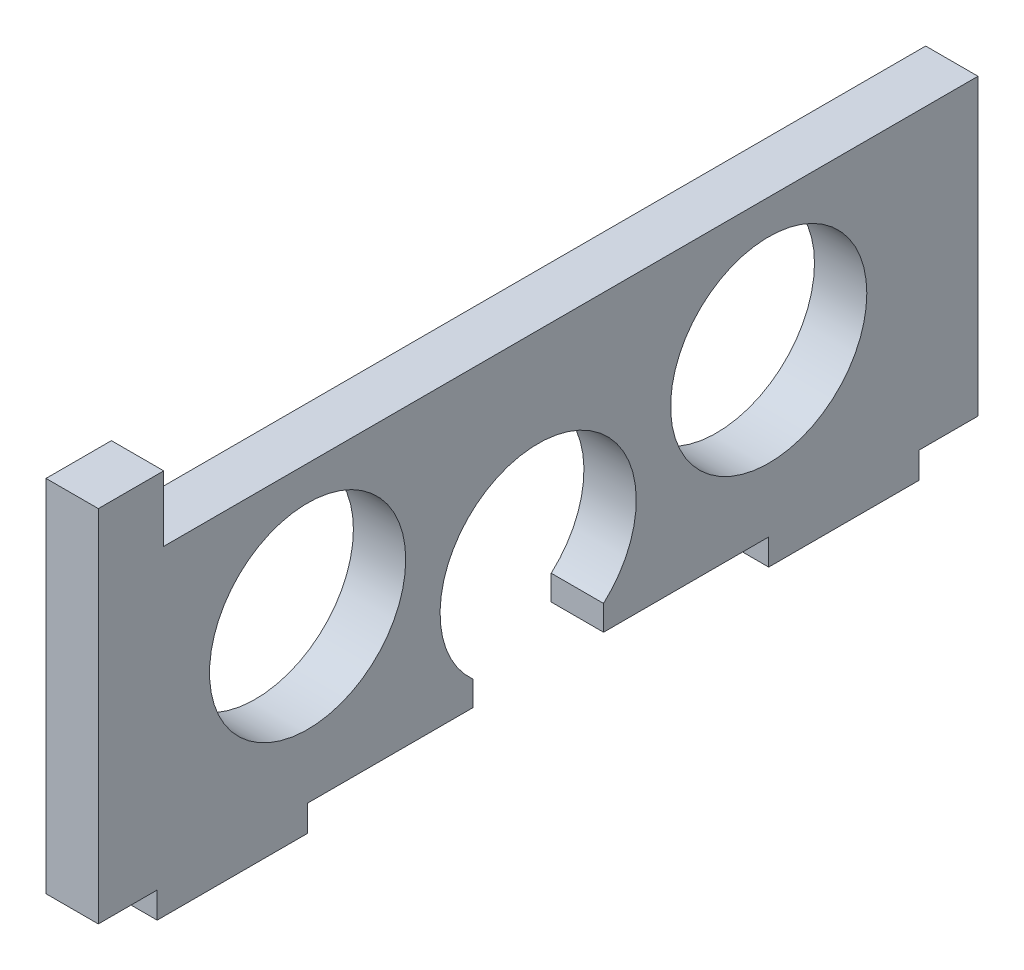
ISO-10303-21;
HEADER;
FILE_DESCRIPTION(('STEP AP214'),'2;1');
FILE_NAME('part.step','',(''),(''),'','','');
FILE_SCHEMA(('AUTOMOTIVE_DESIGN { 1 0 10303 214 1 1 1 1 }'));
ENDSEC;
DATA;
#1=APPLICATION_CONTEXT('core data for automotive mechanical design processes');
#2=APPLICATION_PROTOCOL_DEFINITION('international standard','automotive_design',2000,#1);
#3=PRODUCT_CONTEXT('',#1,'mechanical');
#4=PRODUCT('Part','Part','',(#3));
#5=PRODUCT_RELATED_PRODUCT_CATEGORY('part','',(#4));
#6=PRODUCT_DEFINITION_FORMATION('','',#4);
#7=PRODUCT_DEFINITION_CONTEXT('part definition',#1,'design');
#8=PRODUCT_DEFINITION('design','',#6,#7);
#9=PRODUCT_DEFINITION_SHAPE('','',#8);
#10=(LENGTH_UNIT() NAMED_UNIT(*) SI_UNIT(.MILLI.,.METRE.));
#11=(NAMED_UNIT(*) PLANE_ANGLE_UNIT() SI_UNIT($,.RADIAN.));
#12=(NAMED_UNIT(*) SI_UNIT($,.STERADIAN.) SOLID_ANGLE_UNIT());
#13=UNCERTAINTY_MEASURE_WITH_UNIT(LENGTH_MEASURE(1.E-05),#10,'distance_accuracy_value','');
#14=(GEOMETRIC_REPRESENTATION_CONTEXT(3) GLOBAL_UNCERTAINTY_ASSIGNED_CONTEXT((#13)) GLOBAL_UNIT_ASSIGNED_CONTEXT((#10,
#11,#12)) REPRESENTATION_CONTEXT('',''));
#15=CARTESIAN_POINT('',(0.,0.,0.));
#16=DIRECTION('',(0.,0.,1.));
#17=DIRECTION('',(1.,0.,0.));
#18=AXIS2_PLACEMENT_3D('',#15,#16,#17);
#19=CARTESIAN_POINT('',(1.6,4.3,0.));
#20=DIRECTION('',(-1.,0.,0.));
#21=DIRECTION('',(0.,0.,1.));
#22=AXIS2_PLACEMENT_3D('',#19,#20,#21);
#23=PLANE('',#22);
#24=DIRECTION('',(0.,-1.,0.));
#25=VECTOR('',#24,1.);
#26=CARTESIAN_POINT('',(1.6,12.3,11.45));
#27=LINE('',#26,#25);
#28=CARTESIAN_POINT('',(1.6,12.3,11.45));
#29=VERTEX_POINT('',#28);
#30=CARTESIAN_POINT('',(1.6,10.3,11.45));
#31=VERTEX_POINT('',#30);
#32=EDGE_CURVE('E383',#29,#31,#27,.T.);
#33=ORIENTED_EDGE('',*,*,#32,.F.);
#34=DIRECTION('',(0.,0.,-1.));
#35=VECTOR('',#34,1.);
#36=CARTESIAN_POINT('',(1.6,12.3,13.45));
#37=LINE('',#36,#35);
#38=CARTESIAN_POINT('',(1.6,12.3,13.45));
#39=VERTEX_POINT('',#38);
#40=EDGE_CURVE('E312',#39,#29,#37,.T.);
#41=ORIENTED_EDGE('',*,*,#40,.F.);
#42=DIRECTION('',(0.,1.,0.));
#43=VECTOR('',#42,1.);
#44=CARTESIAN_POINT('',(1.6,1.3,13.45));
#45=LINE('',#44,#43);
#46=CARTESIAN_POINT('',(1.6,1.3,13.45));
#47=VERTEX_POINT('',#46);
#48=EDGE_CURVE('E294',#47,#39,#45,.T.);
#49=ORIENTED_EDGE('',*,*,#48,.F.);
#50=DIRECTION('',(0.,0.,-1.));
#51=VECTOR('',#50,1.);
#52=CARTESIAN_POINT('',(1.6,1.3,13.45));
#53=LINE('',#52,#51);
#54=CARTESIAN_POINT('',(1.6,1.3,11.65));
#55=VERTEX_POINT('',#54);
#56=EDGE_CURVE('E303',#47,#55,#53,.T.);
#57=ORIENTED_EDGE('',*,*,#56,.T.);
#58=DIRECTION('',(0.,-1.,0.));
#59=VECTOR('',#58,1.);
#60=CARTESIAN_POINT('',(1.6,1.3,11.65));
#61=LINE('',#60,#59);
#62=CARTESIAN_POINT('',(1.6,0.5,11.65));
#63=VERTEX_POINT('',#62);
#64=EDGE_CURVE('E309',#55,#63,#61,.T.);
#65=ORIENTED_EDGE('',*,*,#64,.T.);
#66=DIRECTION('',(0.,0.,-1.));
#67=VECTOR('',#66,1.);
#68=CARTESIAN_POINT('',(1.6,0.5,11.65));
#69=LINE('',#68,#67);
#70=CARTESIAN_POINT('',(1.6,0.5,7.05));
#71=VERTEX_POINT('',#70);
#72=EDGE_CURVE('E526',#63,#71,#69,.T.);
#73=ORIENTED_EDGE('',*,*,#72,.T.);
#74=DIRECTION('',(0.,1.,0.));
#75=VECTOR('',#74,1.);
#76=CARTESIAN_POINT('',(1.6,0.5,7.05));
#77=LINE('',#76,#75);
#78=CARTESIAN_POINT('',(1.6,1.3,7.05));
#79=VERTEX_POINT('',#78);
#80=EDGE_CURVE('E523',#71,#79,#77,.T.);
#81=ORIENTED_EDGE('',*,*,#80,.T.);
#82=DIRECTION('',(0.,0.,-1.));
#83=VECTOR('',#82,1.);
#84=CARTESIAN_POINT('',(1.6,1.3,7.05));
#85=LINE('',#84,#83);
#86=CARTESIAN_POINT('',(1.6,1.3,2.));
#87=VERTEX_POINT('',#86);
#88=EDGE_CURVE('E520',#79,#87,#85,.T.);
#89=ORIENTED_EDGE('',*,*,#88,.T.);
#90=DIRECTION('',(0.,1.,0.));
#91=VECTOR('',#90,1.);
#92=CARTESIAN_POINT('',(1.6,1.3,2.));
#93=LINE('',#92,#91);
#94=CARTESIAN_POINT('',(1.6,2.06393202250021,2.));
#95=VERTEX_POINT('',#94);
#96=EDGE_CURVE('E517',#87,#95,#93,.T.);
#97=ORIENTED_EDGE('',*,*,#96,.T.);
#98=CARTESIAN_POINT('',(1.6,4.3,0.));
#99=DIRECTION('',(-1.,0.,0.));
#100=DIRECTION('',(0.,0.,1.));
#101=AXIS2_PLACEMENT_3D('',#98,#99,#100);
#102=CIRCLE('',#101,3.);
#103=CARTESIAN_POINT('',(1.6,2.06393202250021,-2.));
#104=VERTEX_POINT('',#103);
#105=EDGE_CURVE('E514',#95,#104,#102,.T.);
#106=ORIENTED_EDGE('',*,*,#105,.T.);
#107=DIRECTION('',(0.,1.,0.));
#108=VECTOR('',#107,1.);
#109=CARTESIAN_POINT('',(1.6,1.3,-2.));
#110=LINE('',#109,#108);
#111=CARTESIAN_POINT('',(1.6,1.3,-2.));
#112=VERTEX_POINT('',#111);
#113=EDGE_CURVE('E510',#112,#104,#110,.T.);
#114=ORIENTED_EDGE('',*,*,#113,.F.);
#115=DIRECTION('',(0.,0.,1.));
#116=VECTOR('',#115,1.);
#117=CARTESIAN_POINT('',(1.6,1.3,-7.05));
#118=LINE('',#117,#116);
#119=CARTESIAN_POINT('',(1.6,1.3,-7.05));
#120=VERTEX_POINT('',#119);
#121=EDGE_CURVE('E506',#120,#112,#118,.T.);
#122=ORIENTED_EDGE('',*,*,#121,.F.);
#123=DIRECTION('',(0.,1.,0.));
#124=VECTOR('',#123,1.);
#125=CARTESIAN_POINT('',(1.6,0.5,-7.05));
#126=LINE('',#125,#124);
#127=CARTESIAN_POINT('',(1.6,0.5,-7.05));
#128=VERTEX_POINT('',#127);
#129=EDGE_CURVE('E502',#128,#120,#126,.T.);
#130=ORIENTED_EDGE('',*,*,#129,.F.);
#131=DIRECTION('',(0.,0.,1.));
#132=VECTOR('',#131,1.);
#133=CARTESIAN_POINT('',(1.6,0.5,-11.65));
#134=LINE('',#133,#132);
#135=CARTESIAN_POINT('',(1.6,0.5,-11.65));
#136=VERTEX_POINT('',#135);
#137=EDGE_CURVE('E498',#136,#128,#134,.T.);
#138=ORIENTED_EDGE('',*,*,#137,.F.);
#139=DIRECTION('',(0.,-1.,0.));
#140=VECTOR('',#139,1.);
#141=CARTESIAN_POINT('',(1.6,1.3,-11.65));
#142=LINE('',#141,#140);
#143=CARTESIAN_POINT('',(1.6,1.3,-11.65));
#144=VERTEX_POINT('',#143);
#145=EDGE_CURVE('E494',#144,#136,#142,.T.);
#146=ORIENTED_EDGE('',*,*,#145,.F.);
#147=DIRECTION('',(0.,0.,1.));
#148=VECTOR('',#147,1.);
#149=CARTESIAN_POINT('',(1.6,1.3,-13.45));
#150=LINE('',#149,#148);
#151=CARTESIAN_POINT('',(1.6,1.3,-13.45));
#152=VERTEX_POINT('',#151);
#153=EDGE_CURVE('E490',#152,#144,#150,.T.);
#154=ORIENTED_EDGE('',*,*,#153,.F.);
#155=DIRECTION('',(0.,-1.,0.));
#156=VECTOR('',#155,1.);
#157=CARTESIAN_POINT('',(1.6,10.3,-13.45));
#158=LINE('',#157,#156);
#159=CARTESIAN_POINT('',(1.6,10.3,-13.45));
#160=VERTEX_POINT('',#159);
#161=EDGE_CURVE('E486',#160,#152,#158,.T.);
#162=ORIENTED_EDGE('',*,*,#161,.F.);
#163=DIRECTION('',(0.,0.,-1.));
#164=VECTOR('',#163,1.);
#165=CARTESIAN_POINT('',(1.6,10.3,11.45));
#166=LINE('',#165,#164);
#167=EDGE_CURVE('E483',#31,#160,#166,.T.);
#168=ORIENTED_EDGE('',*,*,#167,.F.);
#169=EDGE_LOOP('',(#33,#41,#49,#57,#65,#73,#81,#89,#97,#106,#114,#122,#130,#138,#146,#154,#162,#168));
#170=FACE_BOUND('',#169,.T.);
#171=CARTESIAN_POINT('',(1.6,6.25,7.05));
#172=DIRECTION('',(1.,0.,0.));
#173=DIRECTION('',(0.,0.,-1.));
#174=AXIS2_PLACEMENT_3D('',#171,#172,#173);
#175=CIRCLE('',#174,3.);
#176=CARTESIAN_POINT('',(1.6,6.25,4.05));
#177=VERTEX_POINT('',#176);
#178=EDGE_CURVE('E324',#177,#177,#175,.T.);
#179=ORIENTED_EDGE('',*,*,#178,.F.);
#180=EDGE_LOOP('',(#179));
#181=FACE_BOUND('',#180,.T.);
#182=CARTESIAN_POINT('',(1.6,6.25,-7.05));
#183=DIRECTION('',(1.,0.,0.));
#184=DIRECTION('',(0.,0.,-1.));
#185=AXIS2_PLACEMENT_3D('',#182,#183,#184);
#186=CIRCLE('',#185,3.);
#187=CARTESIAN_POINT('',(1.6,6.25,-10.05));
#188=VERTEX_POINT('',#187);
#189=EDGE_CURVE('E465',#188,#188,#186,.T.);
#190=ORIENTED_EDGE('',*,*,#189,.F.);
#191=EDGE_LOOP('',(#190));
#192=FACE_BOUND('',#191,.T.);
#193=ADVANCED_FACE('F159',(#170,#181,#192),#23,.F.);
#194=CARTESIAN_POINT('',(0.,4.3,0.));
#195=DIRECTION('',(-1.,0.,0.));
#196=DIRECTION('',(0.,0.,1.));
#197=AXIS2_PLACEMENT_3D('',#194,#195,#196);
#198=PLANE('',#197);
#199=CARTESIAN_POINT('',(0.,6.25,7.05));
#200=DIRECTION('',(1.,0.,0.));
#201=DIRECTION('',(0.,0.,-1.));
#202=AXIS2_PLACEMENT_3D('',#199,#200,#201);
#203=CIRCLE('',#202,3.);
#204=CARTESIAN_POINT('',(0.,6.25,4.05));
#205=VERTEX_POINT('',#204);
#206=EDGE_CURVE('E472',#205,#205,#203,.T.);
#207=ORIENTED_EDGE('',*,*,#206,.T.);
#208=EDGE_LOOP('',(#207));
#209=FACE_BOUND('',#208,.T.);
#210=DIRECTION('',(0.,-1.,0.));
#211=VECTOR('',#210,1.);
#212=CARTESIAN_POINT('',(0.,12.3,11.45));
#213=LINE('',#212,#211);
#214=CARTESIAN_POINT('',(0.,12.3,11.45));
#215=VERTEX_POINT('',#214);
#216=CARTESIAN_POINT('',(0.,10.3,11.45));
#217=VERTEX_POINT('',#216);
#218=EDGE_CURVE('E319',#215,#217,#213,.T.);
#219=ORIENTED_EDGE('',*,*,#218,.T.);
#220=DIRECTION('',(0.,0.,-1.));
#221=VECTOR('',#220,1.);
#222=CARTESIAN_POINT('',(0.,10.3,11.45));
#223=LINE('',#222,#221);
#224=CARTESIAN_POINT('',(0.,10.3,-13.45));
#225=VERTEX_POINT('',#224);
#226=EDGE_CURVE('E323',#217,#225,#223,.T.);
#227=ORIENTED_EDGE('',*,*,#226,.T.);
#228=DIRECTION('',(0.,-1.,0.));
#229=VECTOR('',#228,1.);
#230=CARTESIAN_POINT('',(0.,10.3,-13.45));
#231=LINE('',#230,#229);
#232=CARTESIAN_POINT('',(0.,1.3,-13.45));
#233=VERTEX_POINT('',#232);
#234=EDGE_CURVE('E328',#225,#233,#231,.T.);
#235=ORIENTED_EDGE('',*,*,#234,.T.);
#236=DIRECTION('',(0.,0.,1.));
#237=VECTOR('',#236,1.);
#238=CARTESIAN_POINT('',(0.,1.3,-13.45));
#239=LINE('',#238,#237);
#240=CARTESIAN_POINT('',(0.,1.3,-11.65));
#241=VERTEX_POINT('',#240);
#242=EDGE_CURVE('E332',#233,#241,#239,.T.);
#243=ORIENTED_EDGE('',*,*,#242,.T.);
#244=DIRECTION('',(0.,-1.,0.));
#245=VECTOR('',#244,1.);
#246=CARTESIAN_POINT('',(0.,1.3,-11.65));
#247=LINE('',#246,#245);
#248=CARTESIAN_POINT('',(0.,0.5,-11.65));
#249=VERTEX_POINT('',#248);
#250=EDGE_CURVE('E336',#241,#249,#247,.T.);
#251=ORIENTED_EDGE('',*,*,#250,.T.);
#252=DIRECTION('',(0.,0.,1.));
#253=VECTOR('',#252,1.);
#254=CARTESIAN_POINT('',(0.,0.5,-11.65));
#255=LINE('',#254,#253);
#256=CARTESIAN_POINT('',(0.,0.5,-7.05));
#257=VERTEX_POINT('',#256);
#258=EDGE_CURVE('E340',#249,#257,#255,.T.);
#259=ORIENTED_EDGE('',*,*,#258,.T.);
#260=DIRECTION('',(0.,1.,0.));
#261=VECTOR('',#260,1.);
#262=CARTESIAN_POINT('',(0.,0.5,-7.05));
#263=LINE('',#262,#261);
#264=CARTESIAN_POINT('',(0.,1.3,-7.05));
#265=VERTEX_POINT('',#264);
#266=EDGE_CURVE('E344',#257,#265,#263,.T.);
#267=ORIENTED_EDGE('',*,*,#266,.T.);
#268=DIRECTION('',(0.,0.,1.));
#269=VECTOR('',#268,1.);
#270=CARTESIAN_POINT('',(0.,1.3,-7.05));
#271=LINE('',#270,#269);
#272=CARTESIAN_POINT('',(0.,1.3,-2.));
#273=VERTEX_POINT('',#272);
#274=EDGE_CURVE('E348',#265,#273,#271,.T.);
#275=ORIENTED_EDGE('',*,*,#274,.T.);
#276=DIRECTION('',(0.,1.,0.));
#277=VECTOR('',#276,1.);
#278=CARTESIAN_POINT('',(0.,1.3,-2.));
#279=LINE('',#278,#277);
#280=CARTESIAN_POINT('',(0.,2.06393202250021,-2.));
#281=VERTEX_POINT('',#280);
#282=EDGE_CURVE('E352',#273,#281,#279,.T.);
#283=ORIENTED_EDGE('',*,*,#282,.T.);
#284=CARTESIAN_POINT('',(0.,4.3,0.));
#285=DIRECTION('',(-1.,0.,0.));
#286=DIRECTION('',(0.,0.,1.));
#287=AXIS2_PLACEMENT_3D('',#284,#285,#286);
#288=CIRCLE('',#287,3.);
#289=CARTESIAN_POINT('',(0.,2.06393202250021,2.));
#290=VERTEX_POINT('',#289);
#291=EDGE_CURVE('E356',#290,#281,#288,.T.);
#292=ORIENTED_EDGE('',*,*,#291,.F.);
#293=DIRECTION('',(0.,1.,0.));
#294=VECTOR('',#293,1.);
#295=CARTESIAN_POINT('',(0.,1.3,2.));
#296=LINE('',#295,#294);
#297=CARTESIAN_POINT('',(0.,1.3,2.));
#298=VERTEX_POINT('',#297);
#299=EDGE_CURVE('E360',#298,#290,#296,.T.);
#300=ORIENTED_EDGE('',*,*,#299,.F.);
#301=DIRECTION('',(0.,0.,-1.));
#302=VECTOR('',#301,1.);
#303=CARTESIAN_POINT('',(0.,1.3,7.05));
#304=LINE('',#303,#302);
#305=CARTESIAN_POINT('',(0.,1.3,7.05));
#306=VERTEX_POINT('',#305);
#307=EDGE_CURVE('E363',#306,#298,#304,.T.);
#308=ORIENTED_EDGE('',*,*,#307,.F.);
#309=DIRECTION('',(0.,1.,0.));
#310=VECTOR('',#309,1.);
#311=CARTESIAN_POINT('',(0.,0.5,7.05));
#312=LINE('',#311,#310);
#313=CARTESIAN_POINT('',(0.,0.5,7.05));
#314=VERTEX_POINT('',#313);
#315=EDGE_CURVE('E366',#314,#306,#312,.T.);
#316=ORIENTED_EDGE('',*,*,#315,.F.);
#317=DIRECTION('',(0.,0.,-1.));
#318=VECTOR('',#317,1.);
#319=CARTESIAN_POINT('',(0.,0.5,11.65));
#320=LINE('',#319,#318);
#321=CARTESIAN_POINT('',(0.,0.5,11.65));
#322=VERTEX_POINT('',#321);
#323=EDGE_CURVE('E369',#322,#314,#320,.T.);
#324=ORIENTED_EDGE('',*,*,#323,.F.);
#325=DIRECTION('',(0.,-1.,0.));
#326=VECTOR('',#325,1.);
#327=CARTESIAN_POINT('',(0.,1.3,11.65));
#328=LINE('',#327,#326);
#329=CARTESIAN_POINT('',(0.,1.3,11.65));
#330=VERTEX_POINT('',#329);
#331=EDGE_CURVE('E372',#330,#322,#328,.T.);
#332=ORIENTED_EDGE('',*,*,#331,.F.);
#333=DIRECTION('',(0.,0.,-1.));
#334=VECTOR('',#333,1.);
#335=CARTESIAN_POINT('',(0.,1.3,13.45));
#336=LINE('',#335,#334);
#337=CARTESIAN_POINT('',(0.,1.3,13.45));
#338=VERTEX_POINT('',#337);
#339=EDGE_CURVE('E375',#338,#330,#336,.T.);
#340=ORIENTED_EDGE('',*,*,#339,.F.);
#341=DIRECTION('',(0.,1.,0.));
#342=VECTOR('',#341,1.);
#343=CARTESIAN_POINT('',(0.,1.3,13.45));
#344=LINE('',#343,#342);
#345=CARTESIAN_POINT('',(0.,12.3,13.45));
#346=VERTEX_POINT('',#345);
#347=EDGE_CURVE('E296',#338,#346,#344,.T.);
#348=ORIENTED_EDGE('',*,*,#347,.T.);
#349=DIRECTION('',(0.,0.,-1.));
#350=VECTOR('',#349,1.);
#351=CARTESIAN_POINT('',(0.,12.3,13.45));
#352=LINE('',#351,#350);
#353=EDGE_CURVE('E380',#346,#215,#352,.T.);
#354=ORIENTED_EDGE('',*,*,#353,.T.);
#355=EDGE_LOOP('',(#219,#227,#235,#243,#251,#259,#267,#275,#283,#292,#300,#308,#316,#324,#332,
#340,#348,#354));
#356=FACE_BOUND('',#355,.T.);
#357=CARTESIAN_POINT('',(0.,6.25,-7.05));
#358=DIRECTION('',(1.,0.,0.));
#359=DIRECTION('',(0.,0.,-1.));
#360=AXIS2_PLACEMENT_3D('',#357,#358,#359);
#361=CIRCLE('',#360,3.);
#362=CARTESIAN_POINT('',(0.,6.25,-10.05));
#363=VERTEX_POINT('',#362);
#364=EDGE_CURVE('E468',#363,#363,#361,.T.);
#365=ORIENTED_EDGE('',*,*,#364,.T.);
#366=EDGE_LOOP('',(#365));
#367=FACE_BOUND('',#366,.T.);
#368=ADVANCED_FACE('F435',(#209,#356,#367),#198,.T.);
#369=CARTESIAN_POINT('',(1.6,12.3,11.45));
#370=DIRECTION('',(0.,0.,-1.));
#371=DIRECTION('',(-1.,0.,0.));
#372=AXIS2_PLACEMENT_3D('',#369,#370,#371);
#373=PLANE('',#372);
#374=ORIENTED_EDGE('',*,*,#218,.F.);
#375=DIRECTION('',(-1.,0.,0.));
#376=VECTOR('',#375,1.);
#377=CARTESIAN_POINT('',(1.6,12.3,11.45));
#378=LINE('',#377,#376);
#379=EDGE_CURVE('E12',#29,#215,#378,.T.);
#380=ORIENTED_EDGE('',*,*,#379,.F.);
#381=ORIENTED_EDGE('',*,*,#32,.T.);
#382=DIRECTION('',(-1.,0.,0.));
#383=VECTOR('',#382,1.);
#384=CARTESIAN_POINT('',(1.6,10.3,11.45));
#385=LINE('',#384,#383);
#386=EDGE_CURVE('E163',#31,#217,#385,.T.);
#387=ORIENTED_EDGE('',*,*,#386,.T.);
#388=EDGE_LOOP('',(#374,#380,#381,#387));
#389=FACE_BOUND('',#388,.T.);
#390=ADVANCED_FACE('F161',(#389),#373,.T.);
#391=CARTESIAN_POINT('',(1.6,12.3,13.45));
#392=DIRECTION('',(0.,1.,0.));
#393=DIRECTION('',(0.,0.,1.));
#394=AXIS2_PLACEMENT_3D('',#391,#392,#393);
#395=PLANE('',#394);
#396=ORIENTED_EDGE('',*,*,#353,.F.);
#397=DIRECTION('',(-1.,0.,0.));
#398=VECTOR('',#397,1.);
#399=CARTESIAN_POINT('',(1.6,12.3,13.45));
#400=LINE('',#399,#398);
#401=EDGE_CURVE('E170',#39,#346,#400,.T.);
#402=ORIENTED_EDGE('',*,*,#401,.F.);
#403=ORIENTED_EDGE('',*,*,#40,.T.);
#404=ORIENTED_EDGE('',*,*,#379,.T.);
#405=EDGE_LOOP('',(#396,#402,#403,#404));
#406=FACE_BOUND('',#405,.T.);
#407=ADVANCED_FACE('F437',(#406),#395,.T.);
#408=CARTESIAN_POINT('',(1.6,1.3,13.45));
#409=DIRECTION('',(0.,0.,1.));
#410=DIRECTION('',(1.,0.,0.));
#411=AXIS2_PLACEMENT_3D('',#408,#409,#410);
#412=PLANE('',#411);
#413=ORIENTED_EDGE('',*,*,#347,.F.);
#414=DIRECTION('',(-1.,0.,0.));
#415=VECTOR('',#414,1.);
#416=CARTESIAN_POINT('',(1.6,1.3,13.45));
#417=LINE('',#416,#415);
#418=EDGE_CURVE('E290',#47,#338,#417,.T.);
#419=ORIENTED_EDGE('',*,*,#418,.F.);
#420=ORIENTED_EDGE('',*,*,#48,.T.);
#421=ORIENTED_EDGE('',*,*,#401,.T.);
#422=EDGE_LOOP('',(#413,#419,#420,#421));
#423=FACE_BOUND('',#422,.T.);
#424=ADVANCED_FACE('F292',(#423),#412,.T.);
#425=CARTESIAN_POINT('',(1.6,1.3,13.45));
#426=DIRECTION('',(0.,1.,0.));
#427=DIRECTION('',(0.,0.,1.));
#428=AXIS2_PLACEMENT_3D('',#425,#426,#427);
#429=PLANE('',#428);
#430=ORIENTED_EDGE('',*,*,#339,.T.);
#431=DIRECTION('',(-1.,0.,0.));
#432=VECTOR('',#431,1.);
#433=CARTESIAN_POINT('',(1.6,1.3,11.65));
#434=LINE('',#433,#432);
#435=EDGE_CURVE('E300',#55,#330,#434,.T.);
#436=ORIENTED_EDGE('',*,*,#435,.F.);
#437=ORIENTED_EDGE('',*,*,#56,.F.);
#438=ORIENTED_EDGE('',*,*,#418,.T.);
#439=EDGE_LOOP('',(#430,#436,#437,#438));
#440=FACE_BOUND('',#439,.T.);
#441=ADVANCED_FACE('F304',(#440),#429,.F.);
#442=CARTESIAN_POINT('',(1.6,1.3,11.65));
#443=DIRECTION('',(0.,0.,-1.));
#444=DIRECTION('',(-1.,0.,0.));
#445=AXIS2_PLACEMENT_3D('',#442,#443,#444);
#446=PLANE('',#445);
#447=ORIENTED_EDGE('',*,*,#331,.T.);
#448=DIRECTION('',(-1.,0.,0.));
#449=VECTOR('',#448,1.);
#450=CARTESIAN_POINT('',(1.6,0.5,11.65));
#451=LINE('',#450,#449);
#452=EDGE_CURVE('E389',#63,#322,#451,.T.);
#453=ORIENTED_EDGE('',*,*,#452,.F.);
#454=ORIENTED_EDGE('',*,*,#64,.F.);
#455=ORIENTED_EDGE('',*,*,#435,.T.);
#456=EDGE_LOOP('',(#447,#453,#454,#455));
#457=FACE_BOUND('',#456,.T.);
#458=ADVANCED_FACE('F533',(#457),#446,.F.);
#459=CARTESIAN_POINT('',(1.6,0.5,11.65));
#460=DIRECTION('',(0.,1.,0.));
#461=DIRECTION('',(0.,0.,1.));
#462=AXIS2_PLACEMENT_3D('',#459,#460,#461);
#463=PLANE('',#462);
#464=ORIENTED_EDGE('',*,*,#323,.T.);
#465=DIRECTION('',(-1.,0.,0.));
#466=VECTOR('',#465,1.);
#467=CARTESIAN_POINT('',(1.6,0.5,7.05));
#468=LINE('',#467,#466);
#469=EDGE_CURVE('E393',#71,#314,#468,.T.);
#470=ORIENTED_EDGE('',*,*,#469,.F.);
#471=ORIENTED_EDGE('',*,*,#72,.F.);
#472=ORIENTED_EDGE('',*,*,#452,.T.);
#473=EDGE_LOOP('',(#464,#470,#471,#472));
#474=FACE_BOUND('',#473,.T.);
#475=ADVANCED_FACE('F537',(#474),#463,.F.);
#476=CARTESIAN_POINT('',(1.6,0.5,7.05));
#477=DIRECTION('',(0.,0.,1.));
#478=DIRECTION('',(1.,0.,0.));
#479=AXIS2_PLACEMENT_3D('',#476,#477,#478);
#480=PLANE('',#479);
#481=ORIENTED_EDGE('',*,*,#315,.T.);
#482=DIRECTION('',(-1.,0.,0.));
#483=VECTOR('',#482,1.);
#484=CARTESIAN_POINT('',(1.6,1.3,7.05));
#485=LINE('',#484,#483);
#486=EDGE_CURVE('E397',#79,#306,#485,.T.);
#487=ORIENTED_EDGE('',*,*,#486,.F.);
#488=ORIENTED_EDGE('',*,*,#80,.F.);
#489=ORIENTED_EDGE('',*,*,#469,.T.);
#490=EDGE_LOOP('',(#481,#487,#488,#489));
#491=FACE_BOUND('',#490,.T.);
#492=ADVANCED_FACE('F542',(#491),#480,.F.);
#493=CARTESIAN_POINT('',(1.6,1.3,7.05));
#494=DIRECTION('',(0.,1.,0.));
#495=DIRECTION('',(0.,0.,1.));
#496=AXIS2_PLACEMENT_3D('',#493,#494,#495);
#497=PLANE('',#496);
#498=ORIENTED_EDGE('',*,*,#307,.T.);
#499=DIRECTION('',(-1.,0.,0.));
#500=VECTOR('',#499,1.);
#501=CARTESIAN_POINT('',(1.6,1.3,2.));
#502=LINE('',#501,#500);
#503=EDGE_CURVE('E401',#87,#298,#502,.T.);
#504=ORIENTED_EDGE('',*,*,#503,.F.);
#505=ORIENTED_EDGE('',*,*,#88,.F.);
#506=ORIENTED_EDGE('',*,*,#486,.T.);
#507=EDGE_LOOP('',(#498,#504,#505,#506));
#508=FACE_BOUND('',#507,.T.);
#509=ADVANCED_FACE('F548',(#508),#497,.F.);
#510=CARTESIAN_POINT('',(1.6,1.3,2.));
#511=DIRECTION('',(0.,0.,1.));
#512=DIRECTION('',(0.,-1.,0.));
#513=AXIS2_PLACEMENT_3D('',#510,#511,#512);
#514=PLANE('',#513);
#515=ORIENTED_EDGE('',*,*,#299,.T.);
#516=DIRECTION('',(-1.,0.,0.));
#517=VECTOR('',#516,1.);
#518=CARTESIAN_POINT('',(1.6,2.06393202250021,2.));
#519=LINE('',#518,#517);
#520=EDGE_CURVE('E405',#95,#290,#519,.T.);
#521=ORIENTED_EDGE('',*,*,#520,.F.);
#522=ORIENTED_EDGE('',*,*,#96,.F.);
#523=ORIENTED_EDGE('',*,*,#503,.T.);
#524=EDGE_LOOP('',(#515,#521,#522,#523));
#525=FACE_BOUND('',#524,.T.);
#526=ADVANCED_FACE('F552',(#525),#514,.F.);
#527=CARTESIAN_POINT('',(1.6,4.3,0.));
#528=DIRECTION('',(-1.,0.,0.));
#529=DIRECTION('',(0.,0.,1.));
#530=AXIS2_PLACEMENT_3D('',#527,#528,#529);
#531=CYLINDRICAL_SURFACE('',#530,3.);
#532=ORIENTED_EDGE('',*,*,#291,.T.);
#533=DIRECTION('',(-1.,0.,0.));
#534=VECTOR('',#533,1.);
#535=CARTESIAN_POINT('',(1.6,2.06393202250021,-2.));
#536=LINE('',#535,#534);
#537=EDGE_CURVE('E409',#104,#281,#536,.T.);
#538=ORIENTED_EDGE('',*,*,#537,.F.);
#539=ORIENTED_EDGE('',*,*,#105,.F.);
#540=ORIENTED_EDGE('',*,*,#520,.T.);
#541=EDGE_LOOP('',(#532,#538,#539,#540));
#542=FACE_BOUND('',#541,.T.);
#543=ADVANCED_FACE('F557',(#542),#531,.F.);
#544=CARTESIAN_POINT('',(1.6,1.3,-2.));
#545=DIRECTION('',(0.,0.,1.));
#546=DIRECTION('',(0.,-1.,0.));
#547=AXIS2_PLACEMENT_3D('',#544,#545,#546);
#548=PLANE('',#547);
#549=ORIENTED_EDGE('',*,*,#282,.F.);
#550=DIRECTION('',(-1.,0.,0.));
#551=VECTOR('',#550,1.);
#552=CARTESIAN_POINT('',(1.6,1.3,-2.));
#553=LINE('',#552,#551);
#554=EDGE_CURVE('E412',#112,#273,#553,.T.);
#555=ORIENTED_EDGE('',*,*,#554,.F.);
#556=ORIENTED_EDGE('',*,*,#113,.T.);
#557=ORIENTED_EDGE('',*,*,#537,.T.);
#558=EDGE_LOOP('',(#549,#555,#556,#557));
#559=FACE_BOUND('',#558,.T.);
#560=ADVANCED_FACE('F584',(#559),#548,.T.);
#561=CARTESIAN_POINT('',(1.6,1.3,-7.05));
#562=DIRECTION('',(0.,-1.,0.));
#563=DIRECTION('',(0.,0.,-1.));
#564=AXIS2_PLACEMENT_3D('',#561,#562,#563);
#565=PLANE('',#564);
#566=ORIENTED_EDGE('',*,*,#274,.F.);
#567=DIRECTION('',(-1.,0.,0.));
#568=VECTOR('',#567,1.);
#569=CARTESIAN_POINT('',(1.6,1.3,-7.05));
#570=LINE('',#569,#568);
#571=EDGE_CURVE('E415',#120,#265,#570,.T.);
#572=ORIENTED_EDGE('',*,*,#571,.F.);
#573=ORIENTED_EDGE('',*,*,#121,.T.);
#574=ORIENTED_EDGE('',*,*,#554,.T.);
#575=EDGE_LOOP('',(#566,#572,#573,#574));
#576=FACE_BOUND('',#575,.T.);
#577=ADVANCED_FACE('F564',(#576),#565,.T.);
#578=CARTESIAN_POINT('',(1.6,0.5,-7.05));
#579=DIRECTION('',(0.,0.,1.));
#580=DIRECTION('',(1.,0.,0.));
#581=AXIS2_PLACEMENT_3D('',#578,#579,#580);
#582=PLANE('',#581);
#583=ORIENTED_EDGE('',*,*,#266,.F.);
#584=DIRECTION('',(-1.,0.,0.));
#585=VECTOR('',#584,1.);
#586=CARTESIAN_POINT('',(1.6,0.5,-7.05));
#587=LINE('',#586,#585);
#588=EDGE_CURVE('E418',#128,#257,#587,.T.);
#589=ORIENTED_EDGE('',*,*,#588,.F.);
#590=ORIENTED_EDGE('',*,*,#129,.T.);
#591=ORIENTED_EDGE('',*,*,#571,.T.);
#592=EDGE_LOOP('',(#583,#589,#590,#591));
#593=FACE_BOUND('',#592,.T.);
#594=ADVANCED_FACE('F568',(#593),#582,.T.);
#595=CARTESIAN_POINT('',(1.6,0.5,-11.65));
#596=DIRECTION('',(0.,-1.,0.));
#597=DIRECTION('',(0.,0.,-1.));
#598=AXIS2_PLACEMENT_3D('',#595,#596,#597);
#599=PLANE('',#598);
#600=ORIENTED_EDGE('',*,*,#258,.F.);
#601=DIRECTION('',(-1.,0.,0.));
#602=VECTOR('',#601,1.);
#603=CARTESIAN_POINT('',(1.6,0.5,-11.65));
#604=LINE('',#603,#602);
#605=EDGE_CURVE('E421',#136,#249,#604,.T.);
#606=ORIENTED_EDGE('',*,*,#605,.F.);
#607=ORIENTED_EDGE('',*,*,#137,.T.);
#608=ORIENTED_EDGE('',*,*,#588,.T.);
#609=EDGE_LOOP('',(#600,#606,#607,#608));
#610=FACE_BOUND('',#609,.T.);
#611=ADVANCED_FACE('F573',(#610),#599,.T.);
#612=CARTESIAN_POINT('',(1.6,1.3,-11.65));
#613=DIRECTION('',(0.,0.,-1.));
#614=DIRECTION('',(-1.,0.,0.));
#615=AXIS2_PLACEMENT_3D('',#612,#613,#614);
#616=PLANE('',#615);
#617=ORIENTED_EDGE('',*,*,#250,.F.);
#618=DIRECTION('',(-1.,0.,0.));
#619=VECTOR('',#618,1.);
#620=CARTESIAN_POINT('',(1.6,1.3,-11.65));
#621=LINE('',#620,#619);
#622=EDGE_CURVE('E424',#144,#241,#621,.T.);
#623=ORIENTED_EDGE('',*,*,#622,.F.);
#624=ORIENTED_EDGE('',*,*,#145,.T.);
#625=ORIENTED_EDGE('',*,*,#605,.T.);
#626=EDGE_LOOP('',(#617,#623,#624,#625));
#627=FACE_BOUND('',#626,.T.);
#628=ADVANCED_FACE('F576',(#627),#616,.T.);
#629=CARTESIAN_POINT('',(1.6,1.3,-13.45));
#630=DIRECTION('',(0.,-1.,0.));
#631=DIRECTION('',(0.,0.,-1.));
#632=AXIS2_PLACEMENT_3D('',#629,#630,#631);
#633=PLANE('',#632);
#634=ORIENTED_EDGE('',*,*,#242,.F.);
#635=DIRECTION('',(-1.,0.,0.));
#636=VECTOR('',#635,1.);
#637=CARTESIAN_POINT('',(1.6,1.3,-13.45));
#638=LINE('',#637,#636);
#639=EDGE_CURVE('E427',#152,#233,#638,.T.);
#640=ORIENTED_EDGE('',*,*,#639,.F.);
#641=ORIENTED_EDGE('',*,*,#153,.T.);
#642=ORIENTED_EDGE('',*,*,#622,.T.);
#643=EDGE_LOOP('',(#634,#640,#641,#642));
#644=FACE_BOUND('',#643,.T.);
#645=ADVANCED_FACE('F581',(#644),#633,.T.);
#646=CARTESIAN_POINT('',(1.6,10.3,-13.45));
#647=DIRECTION('',(0.,0.,-1.));
#648=DIRECTION('',(-1.,0.,0.));
#649=AXIS2_PLACEMENT_3D('',#646,#647,#648);
#650=PLANE('',#649);
#651=ORIENTED_EDGE('',*,*,#234,.F.);
#652=DIRECTION('',(-1.,0.,0.));
#653=VECTOR('',#652,1.);
#654=CARTESIAN_POINT('',(1.6,10.3,-13.45));
#655=LINE('',#654,#653);
#656=EDGE_CURVE('E429',#160,#225,#655,.T.);
#657=ORIENTED_EDGE('',*,*,#656,.F.);
#658=ORIENTED_EDGE('',*,*,#161,.T.);
#659=ORIENTED_EDGE('',*,*,#639,.T.);
#660=EDGE_LOOP('',(#651,#657,#658,#659));
#661=FACE_BOUND('',#660,.T.);
#662=ADVANCED_FACE('F583',(#661),#650,.T.);
#663=CARTESIAN_POINT('',(1.6,10.3,11.45));
#664=DIRECTION('',(0.,1.,0.));
#665=DIRECTION('',(0.,0.,1.));
#666=AXIS2_PLACEMENT_3D('',#663,#664,#665);
#667=PLANE('',#666);
#668=ORIENTED_EDGE('',*,*,#226,.F.);
#669=ORIENTED_EDGE('',*,*,#386,.F.);
#670=ORIENTED_EDGE('',*,*,#167,.T.);
#671=ORIENTED_EDGE('',*,*,#656,.T.);
#672=EDGE_LOOP('',(#668,#669,#670,#671));
#673=FACE_BOUND('',#672,.T.);
#674=ADVANCED_FACE('F433',(#673),#667,.T.);
#675=CARTESIAN_POINT('',(1.6,6.25,7.05));
#676=DIRECTION('',(-1.,0.,0.));
#677=DIRECTION('',(0.,0.,1.));
#678=AXIS2_PLACEMENT_3D('',#675,#676,#677);
#679=CYLINDRICAL_SURFACE('',#678,3.);
#680=ORIENTED_EDGE('',*,*,#178,.T.);
#681=EDGE_LOOP('',(#680));
#682=FACE_BOUND('',#681,.T.);
#683=ORIENTED_EDGE('',*,*,#206,.F.);
#684=EDGE_LOOP('',(#683));
#685=FACE_BOUND('',#684,.T.);
#686=ADVANCED_FACE('F453',(#682,#685),#679,.F.);
#687=CARTESIAN_POINT('',(1.6,6.25,-7.05));
#688=DIRECTION('',(-1.,0.,0.));
#689=DIRECTION('',(0.,0.,1.));
#690=AXIS2_PLACEMENT_3D('',#687,#688,#689);
#691=CYLINDRICAL_SURFACE('',#690,3.);
#692=ORIENTED_EDGE('',*,*,#189,.T.);
#693=EDGE_LOOP('',(#692));
#694=FACE_BOUND('',#693,.T.);
#695=ORIENTED_EDGE('',*,*,#364,.F.);
#696=EDGE_LOOP('',(#695));
#697=FACE_BOUND('',#696,.T.);
#698=ADVANCED_FACE('F456',(#694,#697),#691,.F.);
#699=CLOSED_SHELL('',(#193,#368,#390,#407,#424,#441,#458,#475,#492,#509,#526,#543,#560,#577,
#594,#611,#628,#645,#662,#674,#686,#698));
#700=MANIFOLD_SOLID_BREP('B2',#699);
#701=ADVANCED_BREP_SHAPE_REPRESENTATION('',(#18,#700),#14);
#702=SHAPE_DEFINITION_REPRESENTATION(#9,#701);
ENDSEC;
END-ISO-10303-21;
